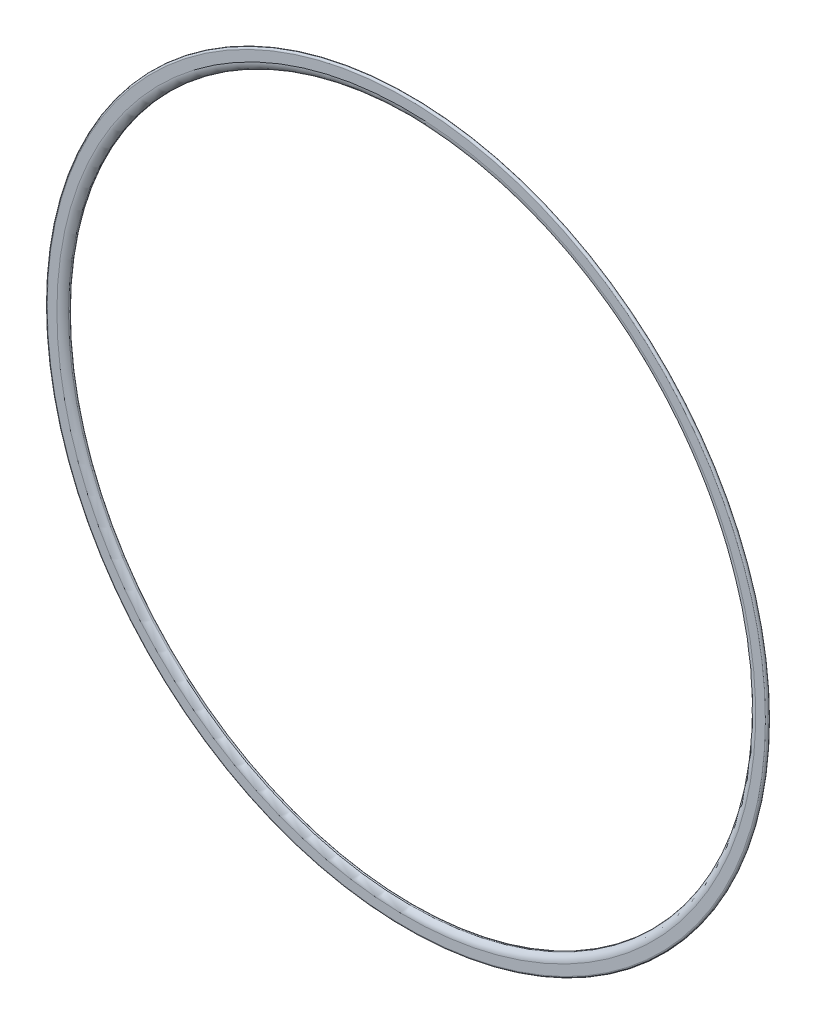
ISO-10303-21;
HEADER;
FILE_DESCRIPTION(('STEP AP214'),'2;1');
FILE_NAME('part.step','',(''),(''),'','','');
FILE_SCHEMA(('AUTOMOTIVE_DESIGN { 1 0 10303 214 1 1 1 1 }'));
ENDSEC;
DATA;
#1=APPLICATION_CONTEXT('core data for automotive mechanical design processes');
#2=APPLICATION_PROTOCOL_DEFINITION('international standard','automotive_design',2000,#1);
#3=PRODUCT_CONTEXT('',#1,'mechanical');
#4=PRODUCT('Part','Part','',(#3));
#5=PRODUCT_RELATED_PRODUCT_CATEGORY('part','',(#4));
#6=PRODUCT_DEFINITION_FORMATION('','',#4);
#7=PRODUCT_DEFINITION_CONTEXT('part definition',#1,'design');
#8=PRODUCT_DEFINITION('design','',#6,#7);
#9=PRODUCT_DEFINITION_SHAPE('','',#8);
#10=(LENGTH_UNIT() NAMED_UNIT(*) SI_UNIT(.MILLI.,.METRE.));
#11=(NAMED_UNIT(*) PLANE_ANGLE_UNIT() SI_UNIT($,.RADIAN.));
#12=(NAMED_UNIT(*) SI_UNIT($,.STERADIAN.) SOLID_ANGLE_UNIT());
#13=UNCERTAINTY_MEASURE_WITH_UNIT(LENGTH_MEASURE(1.E-05),#10,'distance_accuracy_value','');
#14=(GEOMETRIC_REPRESENTATION_CONTEXT(3) GLOBAL_UNCERTAINTY_ASSIGNED_CONTEXT((#13)) GLOBAL_UNIT_ASSIGNED_CONTEXT((#10,
#11,#12)) REPRESENTATION_CONTEXT('',''));
#15=CARTESIAN_POINT('',(0.,0.,0.));
#16=DIRECTION('',(0.,0.,1.));
#17=DIRECTION('',(1.,0.,0.));
#18=AXIS2_PLACEMENT_3D('',#15,#16,#17);
#19=CARTESIAN_POINT('',(0.,0.,0.));
#20=DIRECTION('',(0.,0.,-1.));
#21=DIRECTION('',(-1.,0.,0.));
#22=AXIS2_PLACEMENT_3D('',#19,#20,#21);
#23=TOROIDAL_SURFACE('',#22,105.,0.5);
#24=CARTESIAN_POINT('',(0.,0.,0.499999999999999));
#25=DIRECTION('',(0.,0.,-1.));
#26=DIRECTION('',(-1.,0.,0.));
#27=AXIS2_PLACEMENT_3D('',#24,#25,#26);
#28=CIRCLE('',#27,105.);
#29=CARTESIAN_POINT('',(-105.,0.,0.499999999999999));
#30=VERTEX_POINT('',#29);
#31=EDGE_CURVE('E10',#30,#30,#28,.T.);
#32=ORIENTED_EDGE('',*,*,#31,.T.);
#33=EDGE_LOOP('',(#32));
#34=FACE_BOUND('',#33,.T.);
#35=CARTESIAN_POINT('',(0.,0.,-0.500000000000001));
#36=DIRECTION('',(0.,0.,-1.));
#37=DIRECTION('',(-1.,0.,0.));
#38=AXIS2_PLACEMENT_3D('',#35,#36,#37);
#39=CIRCLE('',#38,105.);
#40=CARTESIAN_POINT('',(-105.,0.,-0.500000000000001));
#41=VERTEX_POINT('',#40);
#42=EDGE_CURVE('E56',#41,#41,#39,.T.);
#43=ORIENTED_EDGE('',*,*,#42,.F.);
#44=EDGE_LOOP('',(#43));
#45=FACE_BOUND('',#44,.T.);
#46=ADVANCED_FACE('F34',(#34,#45),#23,.T.);
#47=CARTESIAN_POINT('',(0.,105.,0.500000000000001));
#48=DIRECTION('',(0.,0.,1.));
#49=DIRECTION('',(1.,0.,0.));
#50=AXIS2_PLACEMENT_3D('',#47,#48,#49);
#51=PLANE('',#50);
#52=CARTESIAN_POINT('',(0.,0.,0.500000000000002));
#53=DIRECTION('',(0.,0.,-1.));
#54=DIRECTION('',(-1.,0.,0.));
#55=AXIS2_PLACEMENT_3D('',#52,#53,#54);
#56=CIRCLE('',#55,102.165063509461);
#57=CARTESIAN_POINT('',(-102.165063509461,0.,0.500000000000002));
#58=VERTEX_POINT('',#57);
#59=EDGE_CURVE('E40',#58,#58,#56,.T.);
#60=ORIENTED_EDGE('',*,*,#59,.T.);
#61=EDGE_LOOP('',(#60));
#62=FACE_BOUND('',#61,.T.);
#63=ORIENTED_EDGE('',*,*,#31,.F.);
#64=EDGE_LOOP('',(#63));
#65=FACE_BOUND('',#64,.T.);
#66=ADVANCED_FACE('F64',(#62,#65),#51,.T.);
#67=CARTESIAN_POINT('',(0.,0.,-1.99999999999999));
#68=DIRECTION('',(0.,0.,-1.));
#69=DIRECTION('',(-1.,0.,0.));
#70=AXIS2_PLACEMENT_3D('',#67,#68,#69);
#71=TOROIDAL_SURFACE('',#70,102.165063509461,2.49999999999999);
#72=CARTESIAN_POINT('',(0.,0.,-0.749999999999996));
#73=DIRECTION('',(0.,0.,-1.));
#74=DIRECTION('',(-1.,0.,0.));
#75=AXIS2_PLACEMENT_3D('',#72,#73,#74);
#76=CIRCLE('',#75,100.);
#77=CARTESIAN_POINT('',(-100.,0.,-0.749999999999996));
#78=VERTEX_POINT('',#77);
#79=EDGE_CURVE('E44',#78,#78,#76,.T.);
#80=ORIENTED_EDGE('',*,*,#79,.T.);
#81=EDGE_LOOP('',(#80));
#82=FACE_BOUND('',#81,.T.);
#83=ORIENTED_EDGE('',*,*,#59,.F.);
#84=EDGE_LOOP('',(#83));
#85=FACE_BOUND('',#84,.T.);
#86=ADVANCED_FACE('F68',(#82,#85),#71,.T.);
#87=CARTESIAN_POINT('',(0.,0.,-0.999999999999998));
#88=DIRECTION('',(0.,0.,-1.));
#89=DIRECTION('',(-1.,0.,0.));
#90=AXIS2_PLACEMENT_3D('',#87,#88,#89);
#91=TOROIDAL_SURFACE('',#90,100.433012701892,0.500000000000002);
#92=CARTESIAN_POINT('',(0.,0.,-1.24999999999999));
#93=DIRECTION('',(0.,0.,-1.));
#94=DIRECTION('',(-1.,0.,0.));
#95=AXIS2_PLACEMENT_3D('',#92,#93,#94);
#96=CIRCLE('',#95,100.866025403784);
#97=CARTESIAN_POINT('',(-100.866025403784,0.,-1.24999999999999));
#98=VERTEX_POINT('',#97);
#99=EDGE_CURVE('E48',#98,#98,#96,.T.);
#100=ORIENTED_EDGE('',*,*,#99,.T.);
#101=EDGE_LOOP('',(#100));
#102=FACE_BOUND('',#101,.T.);
#103=ORIENTED_EDGE('',*,*,#79,.F.);
#104=EDGE_LOOP('',(#103));
#105=FACE_BOUND('',#104,.T.);
#106=ADVANCED_FACE('F72',(#102,#105),#91,.T.);
#107=CARTESIAN_POINT('',(0.,0.,-1.99999999999999));
#108=DIRECTION('',(0.,0.,-1.));
#109=DIRECTION('',(-1.,0.,0.));
#110=AXIS2_PLACEMENT_3D('',#107,#108,#109);
#111=TOROIDAL_SURFACE('',#110,102.165063509461,1.49999999999999);
#112=CARTESIAN_POINT('',(0.,0.,-0.500000000000001));
#113=DIRECTION('',(0.,0.,-1.));
#114=DIRECTION('',(-1.,0.,0.));
#115=AXIS2_PLACEMENT_3D('',#112,#113,#114);
#116=CIRCLE('',#115,102.165063509461);
#117=CARTESIAN_POINT('',(-102.165063509461,0.,-0.500000000000001));
#118=VERTEX_POINT('',#117);
#119=EDGE_CURVE('E53',#118,#118,#116,.T.);
#120=ORIENTED_EDGE('',*,*,#119,.T.);
#121=EDGE_LOOP('',(#120));
#122=FACE_BOUND('',#121,.T.);
#123=ORIENTED_EDGE('',*,*,#99,.F.);
#124=EDGE_LOOP('',(#123));
#125=FACE_BOUND('',#124,.T.);
#126=ADVANCED_FACE('F79',(#122,#125),#111,.F.);
#127=CARTESIAN_POINT('',(0.,105.,-0.500000000000001));
#128=DIRECTION('',(0.,0.,-1.));
#129=DIRECTION('',(-1.,0.,0.));
#130=AXIS2_PLACEMENT_3D('',#127,#128,#129);
#131=PLANE('',#130);
#132=ORIENTED_EDGE('',*,*,#42,.T.);
#133=EDGE_LOOP('',(#132));
#134=FACE_BOUND('',#133,.T.);
#135=ORIENTED_EDGE('',*,*,#119,.F.);
#136=EDGE_LOOP('',(#135));
#137=FACE_BOUND('',#136,.T.);
#138=ADVANCED_FACE('F60',(#134,#137),#131,.T.);
#139=CLOSED_SHELL('',(#46,#66,#86,#106,#126,#138));
#140=MANIFOLD_SOLID_BREP('B2',#139);
#141=ADVANCED_BREP_SHAPE_REPRESENTATION('',(#18,#140),#14);
#142=SHAPE_DEFINITION_REPRESENTATION(#9,#141);
ENDSEC;
END-ISO-10303-21;
